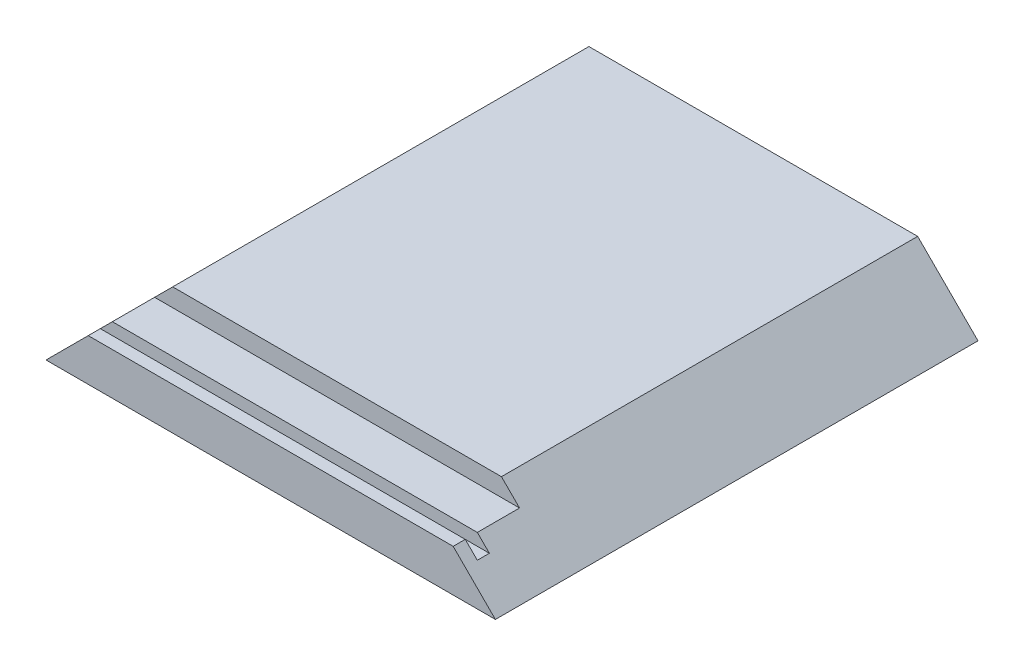
ISO-10303-21;
HEADER;
FILE_DESCRIPTION(('STEP AP214'),'2;1');
FILE_NAME('part.step','',(''),(''),'','','');
FILE_SCHEMA(('AUTOMOTIVE_DESIGN { 1 0 10303 214 1 1 1 1 }'));
ENDSEC;
DATA;
#1=APPLICATION_CONTEXT('core data for automotive mechanical design processes');
#2=APPLICATION_PROTOCOL_DEFINITION('international standard','automotive_design',2000,#1);
#3=PRODUCT_CONTEXT('',#1,'mechanical');
#4=PRODUCT('Part','Part','',(#3));
#5=PRODUCT_RELATED_PRODUCT_CATEGORY('part','',(#4));
#6=PRODUCT_DEFINITION_FORMATION('','',#4);
#7=PRODUCT_DEFINITION_CONTEXT('part definition',#1,'design');
#8=PRODUCT_DEFINITION('design','',#6,#7);
#9=PRODUCT_DEFINITION_SHAPE('','',#8);
#10=(LENGTH_UNIT() NAMED_UNIT(*) SI_UNIT(.MILLI.,.METRE.));
#11=(NAMED_UNIT(*) PLANE_ANGLE_UNIT() SI_UNIT($,.RADIAN.));
#12=(NAMED_UNIT(*) SI_UNIT($,.STERADIAN.) SOLID_ANGLE_UNIT());
#13=UNCERTAINTY_MEASURE_WITH_UNIT(LENGTH_MEASURE(1.E-05),#10,'distance_accuracy_value','');
#14=(GEOMETRIC_REPRESENTATION_CONTEXT(3) GLOBAL_UNCERTAINTY_ASSIGNED_CONTEXT((#13)) GLOBAL_UNIT_ASSIGNED_CONTEXT((#10,
#11,#12)) REPRESENTATION_CONTEXT('',''));
#15=CARTESIAN_POINT('',(0.,0.,0.));
#16=DIRECTION('',(0.,0.,1.));
#17=DIRECTION('',(1.,0.,0.));
#18=AXIS2_PLACEMENT_3D('',#15,#16,#17);
#19=CARTESIAN_POINT('',(37.25,7.,40.));
#20=DIRECTION('',(0.,-1.,0.));
#21=DIRECTION('',(0.,0.,-1.));
#22=AXIS2_PLACEMENT_3D('',#19,#20,#21);
#23=PLANE('',#22);
#24=DIRECTION('',(-1.,0.,0.));
#25=VECTOR('',#24,1.);
#26=CARTESIAN_POINT('',(37.25,7.,38.));
#27=LINE('',#26,#25);
#28=CARTESIAN_POINT('',(30.2499999999999,7.,38.));
#29=VERTEX_POINT('',#28);
#30=CARTESIAN_POINT('',(-30.2499999999999,6.99999999999999,38.));
#31=VERTEX_POINT('',#30);
#32=EDGE_CURVE('E155',#29,#31,#27,.T.);
#33=ORIENTED_EDGE('',*,*,#32,.T.);
#34=DIRECTION('',(0.,0.,1.));
#35=VECTOR('',#34,1.);
#36=CARTESIAN_POINT('',(-30.2499999999999,7.,40.));
#37=LINE('',#36,#35);
#38=CARTESIAN_POINT('',(-30.2499999999999,7.,40.));
#39=VERTEX_POINT('',#38);
#40=EDGE_CURVE('E181',#31,#39,#37,.T.);
#41=ORIENTED_EDGE('',*,*,#40,.T.);
#42=DIRECTION('',(-1.,0.,0.));
#43=VECTOR('',#42,1.);
#44=CARTESIAN_POINT('',(37.25,7.,40.));
#45=LINE('',#44,#43);
#46=CARTESIAN_POINT('',(30.2499999999999,7.,40.));
#47=VERTEX_POINT('',#46);
#48=EDGE_CURVE('E130',#47,#39,#45,.T.);
#49=ORIENTED_EDGE('',*,*,#48,.F.);
#50=DIRECTION('',(0.,0.,-1.));
#51=VECTOR('',#50,1.);
#52=CARTESIAN_POINT('',(30.2499999999999,7.,40.));
#53=LINE('',#52,#51);
#54=EDGE_CURVE('E191',#47,#29,#53,.T.);
#55=ORIENTED_EDGE('',*,*,#54,.T.);
#56=EDGE_LOOP('',(#33,#41,#49,#55));
#57=FACE_BOUND('',#56,.T.);
#58=ADVANCED_FACE('F35',(#57),#23,.F.);
#59=CARTESIAN_POINT('',(-37.25,10.,-40.));
#60=DIRECTION('',(0.,0.,1.));
#61=DIRECTION('',(1.,0.,0.));
#62=AXIS2_PLACEMENT_3D('',#59,#60,#61);
#63=PLANE('',#62);
#64=DIRECTION('',(-1.,0.,0.));
#65=VECTOR('',#64,1.);
#66=CARTESIAN_POINT('',(-37.25,0.,-40.));
#67=LINE('',#66,#65);
#68=CARTESIAN_POINT('',(37.25,0.,-40.));
#69=VERTEX_POINT('',#68);
#70=CARTESIAN_POINT('',(-37.25,0.,-40.));
#71=VERTEX_POINT('',#70);
#72=EDGE_CURVE('E121',#69,#71,#67,.T.);
#73=ORIENTED_EDGE('',*,*,#72,.T.);
#74=DIRECTION('',(-0.707106781186552,-0.707106781186544,0.));
#75=VECTOR('',#74,1.);
#76=CARTESIAN_POINT('',(-37.25,0.,-40.));
#77=LINE('',#76,#75);
#78=CARTESIAN_POINT('',(-27.2499999999999,10.,-40.));
#79=VERTEX_POINT('',#78);
#80=EDGE_CURVE('E115',#79,#71,#77,.T.);
#81=ORIENTED_EDGE('',*,*,#80,.F.);
#82=DIRECTION('',(-1.,0.,0.));
#83=VECTOR('',#82,1.);
#84=CARTESIAN_POINT('',(-37.25,10.,-40.));
#85=LINE('',#84,#83);
#86=CARTESIAN_POINT('',(27.2499999999999,10.,-40.));
#87=VERTEX_POINT('',#86);
#88=EDGE_CURVE('E135',#87,#79,#85,.T.);
#89=ORIENTED_EDGE('',*,*,#88,.F.);
#90=DIRECTION('',(-0.707106781186551,0.707106781186544,0.));
#91=VECTOR('',#90,1.);
#92=CARTESIAN_POINT('',(37.25,0.,-40.));
#93=LINE('',#92,#91);
#94=EDGE_CURVE('E173',#69,#87,#93,.T.);
#95=ORIENTED_EDGE('',*,*,#94,.F.);
#96=EDGE_LOOP('',(#73,#81,#89,#95));
#97=FACE_BOUND('',#96,.T.);
#98=ADVANCED_FACE('F37',(#97),#63,.F.);
#99=CARTESIAN_POINT('',(-37.25,10.,40.));
#100=DIRECTION('',(0.,0.,-1.));
#101=DIRECTION('',(-1.,0.,0.));
#102=AXIS2_PLACEMENT_3D('',#99,#100,#101);
#103=PLANE('',#102);
#104=ORIENTED_EDGE('',*,*,#48,.T.);
#105=DIRECTION('',(-0.707106781186552,-0.707106781186544,0.));
#106=VECTOR('',#105,1.);
#107=CARTESIAN_POINT('',(-37.25,0.,40.));
#108=LINE('',#107,#106);
#109=CARTESIAN_POINT('',(-37.25,0.,40.));
#110=VERTEX_POINT('',#109);
#111=EDGE_CURVE('E112',#39,#110,#108,.T.);
#112=ORIENTED_EDGE('',*,*,#111,.T.);
#113=DIRECTION('',(1.,0.,0.));
#114=VECTOR('',#113,1.);
#115=CARTESIAN_POINT('',(-37.25,0.,40.));
#116=LINE('',#115,#114);
#117=CARTESIAN_POINT('',(37.25,0.,40.));
#118=VERTEX_POINT('',#117);
#119=EDGE_CURVE('E120',#110,#118,#116,.T.);
#120=ORIENTED_EDGE('',*,*,#119,.T.);
#121=DIRECTION('',(-0.707106781186551,0.707106781186544,0.));
#122=VECTOR('',#121,1.);
#123=CARTESIAN_POINT('',(37.25,0.,40.));
#124=LINE('',#123,#122);
#125=EDGE_CURVE('E175',#118,#47,#124,.T.);
#126=ORIENTED_EDGE('',*,*,#125,.T.);
#127=EDGE_LOOP('',(#104,#112,#120,#126));
#128=FACE_BOUND('',#127,.T.);
#129=ADVANCED_FACE('F126',(#128),#103,.F.);
#130=CARTESIAN_POINT('',(0.,10.,0.));
#131=DIRECTION('',(0.,1.,0.));
#132=DIRECTION('',(0.,0.,1.));
#133=AXIS2_PLACEMENT_3D('',#130,#131,#132);
#134=PLANE('',#133);
#135=DIRECTION('',(0.,0.,-1.));
#136=VECTOR('',#135,1.);
#137=CARTESIAN_POINT('',(-27.2499999999999,10.,40.));
#138=LINE('',#137,#136);
#139=CARTESIAN_POINT('',(-27.2499999999999,10.,29.));
#140=VERTEX_POINT('',#139);
#141=EDGE_CURVE('E131',#140,#79,#138,.T.);
#142=ORIENTED_EDGE('',*,*,#141,.F.);
#143=DIRECTION('',(-1.,0.,0.));
#144=VECTOR('',#143,1.);
#145=CARTESIAN_POINT('',(37.25,10.,29.));
#146=LINE('',#145,#144);
#147=CARTESIAN_POINT('',(27.2499999999999,10.,29.));
#148=VERTEX_POINT('',#147);
#149=EDGE_CURVE('E167',#148,#140,#146,.T.);
#150=ORIENTED_EDGE('',*,*,#149,.F.);
#151=DIRECTION('',(0.,0.,-1.));
#152=VECTOR('',#151,1.);
#153=CARTESIAN_POINT('',(27.2499999999999,10.,40.));
#154=LINE('',#153,#152);
#155=EDGE_CURVE('E178',#148,#87,#154,.T.);
#156=ORIENTED_EDGE('',*,*,#155,.T.);
#157=ORIENTED_EDGE('',*,*,#88,.T.);
#158=EDGE_LOOP('',(#142,#150,#156,#157));
#159=FACE_BOUND('',#158,.T.);
#160=ADVANCED_FACE('F235',(#159),#134,.T.);
#161=CARTESIAN_POINT('',(0.,0.,0.));
#162=DIRECTION('',(0.,1.,0.));
#163=DIRECTION('',(0.,0.,1.));
#164=AXIS2_PLACEMENT_3D('',#161,#162,#163);
#165=PLANE('',#164);
#166=DIRECTION('',(0.,0.,-1.));
#167=VECTOR('',#166,1.);
#168=CARTESIAN_POINT('',(37.25,0.,-40.));
#169=LINE('',#168,#167);
#170=EDGE_CURVE('E134',#118,#69,#169,.T.);
#171=ORIENTED_EDGE('',*,*,#170,.F.);
#172=ORIENTED_EDGE('',*,*,#119,.F.);
#173=DIRECTION('',(0.,0.,1.));
#174=VECTOR('',#173,1.);
#175=CARTESIAN_POINT('',(-37.25,0.,-40.));
#176=LINE('',#175,#174);
#177=EDGE_CURVE('E109',#71,#110,#176,.T.);
#178=ORIENTED_EDGE('',*,*,#177,.F.);
#179=ORIENTED_EDGE('',*,*,#72,.F.);
#180=EDGE_LOOP('',(#171,#172,#178,#179));
#181=FACE_BOUND('',#180,.T.);
#182=ADVANCED_FACE('F133',(#181),#165,.F.);
#183=DIRECTION('',(-1.,0.,0.));
#184=VECTOR('',#183,1.);
#185=CARTESIAN_POINT('',(37.25,7.,29.));
#186=LINE('',#185,#184);
#187=CARTESIAN_POINT('',(30.2499999999999,7.,29.));
#188=VERTEX_POINT('',#187);
#189=CARTESIAN_POINT('',(-30.2499999999999,7.,29.));
#190=VERTEX_POINT('',#189);
#191=EDGE_CURVE('E165',#188,#190,#186,.T.);
#192=ORIENTED_EDGE('',*,*,#191,.T.);
#193=DIRECTION('',(0.,0.,1.));
#194=VECTOR('',#193,1.);
#195=CARTESIAN_POINT('',(-30.2499999999999,7.,40.));
#196=LINE('',#195,#194);
#197=CARTESIAN_POINT('',(-30.2499999999999,6.99999999999999,36.));
#198=VERTEX_POINT('',#197);
#199=EDGE_CURVE('E154',#190,#198,#196,.T.);
#200=ORIENTED_EDGE('',*,*,#199,.T.);
#201=DIRECTION('',(-1.,0.,0.));
#202=VECTOR('',#201,1.);
#203=CARTESIAN_POINT('',(37.25,7.,36.));
#204=LINE('',#203,#202);
#205=CARTESIAN_POINT('',(30.2499999999999,7.,36.));
#206=VERTEX_POINT('',#205);
#207=EDGE_CURVE('E145',#206,#198,#204,.T.);
#208=ORIENTED_EDGE('',*,*,#207,.F.);
#209=DIRECTION('',(0.,0.,-1.));
#210=VECTOR('',#209,1.);
#211=CARTESIAN_POINT('',(30.2499999999999,7.,40.));
#212=LINE('',#211,#210);
#213=EDGE_CURVE('E57',#206,#188,#212,.T.);
#214=ORIENTED_EDGE('',*,*,#213,.T.);
#215=EDGE_LOOP('',(#192,#200,#208,#214));
#216=FACE_BOUND('',#215,.T.);
#217=ADVANCED_FACE('F152',(#216),#23,.F.);
#218=CARTESIAN_POINT('',(37.25,10.,29.));
#219=DIRECTION('',(0.,0.,-1.));
#220=DIRECTION('',(0.,1.,0.));
#221=AXIS2_PLACEMENT_3D('',#218,#219,#220);
#222=PLANE('',#221);
#223=ORIENTED_EDGE('',*,*,#149,.T.);
#224=DIRECTION('',(-0.707106781186552,-0.707106781186544,0.));
#225=VECTOR('',#224,1.);
#226=CARTESIAN_POINT('',(5.00000000000043,42.25,28.9999999999999));
#227=LINE('',#226,#225);
#228=EDGE_CURVE('E176',#140,#190,#227,.T.);
#229=ORIENTED_EDGE('',*,*,#228,.T.);
#230=ORIENTED_EDGE('',*,*,#191,.F.);
#231=DIRECTION('',(-0.707106781186551,0.707106781186544,0.));
#232=VECTOR('',#231,1.);
#233=CARTESIAN_POINT('',(32.25,4.99999999999994,29.));
#234=LINE('',#233,#232);
#235=EDGE_CURVE('E160',#188,#148,#234,.T.);
#236=ORIENTED_EDGE('',*,*,#235,.T.);
#237=EDGE_LOOP('',(#223,#229,#230,#236));
#238=FACE_BOUND('',#237,.T.);
#239=ADVANCED_FACE('F229',(#238),#222,.F.);
#240=CARTESIAN_POINT('',(37.25,7.,38.));
#241=DIRECTION('',(0.,0.,1.));
#242=DIRECTION('',(0.,-1.,0.));
#243=AXIS2_PLACEMENT_3D('',#240,#241,#242);
#244=PLANE('',#243);
#245=DIRECTION('',(-1.,0.,0.));
#246=VECTOR('',#245,1.);
#247=CARTESIAN_POINT('',(37.25,5.,38.));
#248=LINE('',#247,#246);
#249=CARTESIAN_POINT('',(32.2499999999999,5.,38.));
#250=VERTEX_POINT('',#249);
#251=CARTESIAN_POINT('',(-32.25,5.,38.));
#252=VERTEX_POINT('',#251);
#253=EDGE_CURVE('E157',#250,#252,#248,.T.);
#254=ORIENTED_EDGE('',*,*,#253,.T.);
#255=DIRECTION('',(0.707106781186552,0.707106781186544,0.));
#256=VECTOR('',#255,1.);
#257=CARTESIAN_POINT('',(3.50000000000043,40.75,37.9999999999999));
#258=LINE('',#257,#256);
#259=EDGE_CURVE('E201',#252,#31,#258,.T.);
#260=ORIENTED_EDGE('',*,*,#259,.T.);
#261=ORIENTED_EDGE('',*,*,#32,.F.);
#262=DIRECTION('',(0.707106781186551,-0.707106781186544,0.));
#263=VECTOR('',#262,1.);
#264=CARTESIAN_POINT('',(33.75,3.49999999999995,38.));
#265=LINE('',#264,#263);
#266=EDGE_CURVE('E187',#29,#250,#265,.T.);
#267=ORIENTED_EDGE('',*,*,#266,.T.);
#268=EDGE_LOOP('',(#254,#260,#261,#267));
#269=FACE_BOUND('',#268,.T.);
#270=ADVANCED_FACE('F199',(#269),#244,.F.);
#271=CARTESIAN_POINT('',(37.25,5.,38.));
#272=DIRECTION('',(0.,-1.,0.));
#273=DIRECTION('',(0.,0.,-1.));
#274=AXIS2_PLACEMENT_3D('',#271,#272,#273);
#275=PLANE('',#274);
#276=DIRECTION('',(-1.,0.,0.));
#277=VECTOR('',#276,1.);
#278=CARTESIAN_POINT('',(37.25,5.,36.));
#279=LINE('',#278,#277);
#280=CARTESIAN_POINT('',(32.2499999999999,5.,36.));
#281=VERTEX_POINT('',#280);
#282=CARTESIAN_POINT('',(-32.2499999999999,5.,36.));
#283=VERTEX_POINT('',#282);
#284=EDGE_CURVE('E147',#281,#283,#279,.T.);
#285=ORIENTED_EDGE('',*,*,#284,.T.);
#286=DIRECTION('',(0.,0.,1.));
#287=VECTOR('',#286,1.);
#288=CARTESIAN_POINT('',(-32.25,5.,38.));
#289=LINE('',#288,#287);
#290=EDGE_CURVE('E50',#283,#252,#289,.T.);
#291=ORIENTED_EDGE('',*,*,#290,.T.);
#292=ORIENTED_EDGE('',*,*,#253,.F.);
#293=DIRECTION('',(0.,0.,-1.));
#294=VECTOR('',#293,1.);
#295=CARTESIAN_POINT('',(32.2499999999999,5.,38.));
#296=LINE('',#295,#294);
#297=EDGE_CURVE('E185',#250,#281,#296,.T.);
#298=ORIENTED_EDGE('',*,*,#297,.T.);
#299=EDGE_LOOP('',(#285,#291,#292,#298));
#300=FACE_BOUND('',#299,.T.);
#301=ADVANCED_FACE('F203',(#300),#275,.F.);
#302=CARTESIAN_POINT('',(37.25,7.,36.));
#303=DIRECTION('',(0.,0.,-1.));
#304=DIRECTION('',(-1.,0.,0.));
#305=AXIS2_PLACEMENT_3D('',#302,#303,#304);
#306=PLANE('',#305);
#307=ORIENTED_EDGE('',*,*,#207,.T.);
#308=DIRECTION('',(-0.707106781186552,-0.707106781186544,0.));
#309=VECTOR('',#308,1.);
#310=CARTESIAN_POINT('',(3.50000000000043,40.75,36.));
#311=LINE('',#310,#309);
#312=EDGE_CURVE('E11',#198,#283,#311,.T.);
#313=ORIENTED_EDGE('',*,*,#312,.T.);
#314=ORIENTED_EDGE('',*,*,#284,.F.);
#315=DIRECTION('',(-0.707106781186551,0.707106781186544,0.));
#316=VECTOR('',#315,1.);
#317=CARTESIAN_POINT('',(33.75,3.49999999999995,36.));
#318=LINE('',#317,#316);
#319=EDGE_CURVE('E43',#281,#206,#318,.T.);
#320=ORIENTED_EDGE('',*,*,#319,.T.);
#321=EDGE_LOOP('',(#307,#313,#314,#320));
#322=FACE_BOUND('',#321,.T.);
#323=ADVANCED_FACE('F144',(#322),#306,.F.);
#324=CARTESIAN_POINT('',(37.25,0.,40.));
#325=DIRECTION('',(-0.707106781186544,-0.707106781186551,0.));
#326=DIRECTION('',(0.707106781186551,-0.707106781186544,0.));
#327=AXIS2_PLACEMENT_3D('',#324,#325,#326);
#328=PLANE('',#327);
#329=ORIENTED_EDGE('',*,*,#213,.F.);
#330=ORIENTED_EDGE('',*,*,#319,.F.);
#331=ORIENTED_EDGE('',*,*,#297,.F.);
#332=ORIENTED_EDGE('',*,*,#266,.F.);
#333=ORIENTED_EDGE('',*,*,#54,.F.);
#334=ORIENTED_EDGE('',*,*,#125,.F.);
#335=ORIENTED_EDGE('',*,*,#170,.T.);
#336=ORIENTED_EDGE('',*,*,#94,.T.);
#337=ORIENTED_EDGE('',*,*,#155,.F.);
#338=ORIENTED_EDGE('',*,*,#235,.F.);
#339=EDGE_LOOP('',(#329,#330,#331,#332,#333,#334,#335,#336,#337,#338));
#340=FACE_BOUND('',#339,.T.);
#341=ADVANCED_FACE('F211',(#340),#328,.F.);
#342=CARTESIAN_POINT('',(-37.25,0.,40.));
#343=DIRECTION('',(0.707106781186544,-0.707106781186552,0.));
#344=DIRECTION('',(0.707106781186552,0.707106781186544,0.));
#345=AXIS2_PLACEMENT_3D('',#342,#343,#344);
#346=PLANE('',#345);
#347=ORIENTED_EDGE('',*,*,#141,.T.);
#348=ORIENTED_EDGE('',*,*,#80,.T.);
#349=ORIENTED_EDGE('',*,*,#177,.T.);
#350=ORIENTED_EDGE('',*,*,#111,.F.);
#351=ORIENTED_EDGE('',*,*,#40,.F.);
#352=ORIENTED_EDGE('',*,*,#259,.F.);
#353=ORIENTED_EDGE('',*,*,#290,.F.);
#354=ORIENTED_EDGE('',*,*,#312,.F.);
#355=ORIENTED_EDGE('',*,*,#199,.F.);
#356=ORIENTED_EDGE('',*,*,#228,.F.);
#357=EDGE_LOOP('',(#347,#348,#349,#350,#351,#352,#353,#354,#355,#356));
#358=FACE_BOUND('',#357,.T.);
#359=ADVANCED_FACE('F111',(#358),#346,.F.);
#360=CLOSED_SHELL('',(#58,#98,#129,#160,#182,#217,#239,#270,#301,#323,#341,#359));
#361=MANIFOLD_SOLID_BREP('B2',#360);
#362=ADVANCED_BREP_SHAPE_REPRESENTATION('',(#18,#361),#14);
#363=SHAPE_DEFINITION_REPRESENTATION(#9,#362);
ENDSEC;
END-ISO-10303-21;
